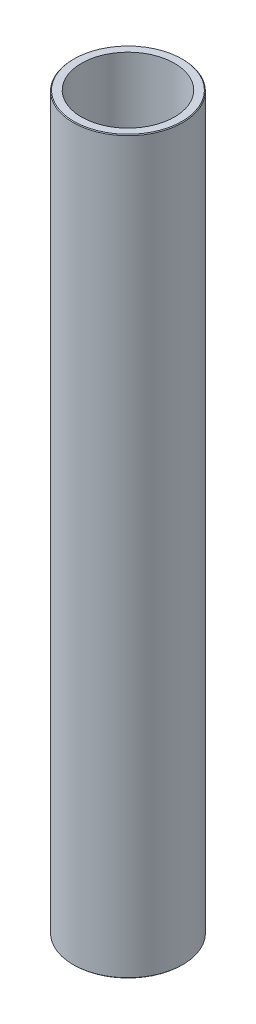
ISO-10303-21;
HEADER;
FILE_DESCRIPTION(('STEP AP214'),'2;1');
FILE_NAME('part.step','',(''),(''),'','','');
FILE_SCHEMA(('AUTOMOTIVE_DESIGN { 1 0 10303 214 1 1 1 1 }'));
ENDSEC;
DATA;
#1=APPLICATION_CONTEXT('core data for automotive mechanical design processes');
#2=APPLICATION_PROTOCOL_DEFINITION('international standard','automotive_design',2000,#1);
#3=PRODUCT_CONTEXT('',#1,'mechanical');
#4=PRODUCT('Part','Part','',(#3));
#5=PRODUCT_RELATED_PRODUCT_CATEGORY('part','',(#4));
#6=PRODUCT_DEFINITION_FORMATION('','',#4);
#7=PRODUCT_DEFINITION_CONTEXT('part definition',#1,'design');
#8=PRODUCT_DEFINITION('design','',#6,#7);
#9=PRODUCT_DEFINITION_SHAPE('','',#8);
#10=(LENGTH_UNIT() NAMED_UNIT(*) SI_UNIT(.MILLI.,.METRE.));
#11=(NAMED_UNIT(*) PLANE_ANGLE_UNIT() SI_UNIT($,.RADIAN.));
#12=(NAMED_UNIT(*) SI_UNIT($,.STERADIAN.) SOLID_ANGLE_UNIT());
#13=UNCERTAINTY_MEASURE_WITH_UNIT(LENGTH_MEASURE(1.E-05),#10,'distance_accuracy_value','');
#14=(GEOMETRIC_REPRESENTATION_CONTEXT(3) GLOBAL_UNCERTAINTY_ASSIGNED_CONTEXT((#13)) GLOBAL_UNIT_ASSIGNED_CONTEXT((#10,
#11,#12)) REPRESENTATION_CONTEXT('',''));
#15=CARTESIAN_POINT('',(0.,0.,0.));
#16=DIRECTION('',(0.,0.,1.));
#17=DIRECTION('',(1.,0.,0.));
#18=AXIS2_PLACEMENT_3D('',#15,#16,#17);
#19=CARTESIAN_POINT('',(0.,600.,0.));
#20=DIRECTION('',(0.,-1.,0.));
#21=DIRECTION('',(0.,0.,-1.));
#22=AXIS2_PLACEMENT_3D('',#19,#20,#21);
#23=CYLINDRICAL_SURFACE('',#22,45.);
#24=CARTESIAN_POINT('',(0.,599.400226660918,0.));
#25=DIRECTION('',(0.,1.,0.));
#26=DIRECTION('',(0.,0.,1.));
#27=AXIS2_PLACEMENT_3D('',#24,#25,#26);
#28=CIRCLE('',#27,45.);
#29=CARTESIAN_POINT('',(0.,599.400226660918,45.));
#30=VERTEX_POINT('',#29);
#31=EDGE_CURVE('E50',#30,#30,#28,.F.);
#32=ORIENTED_EDGE('',*,*,#31,.T.);
#33=EDGE_LOOP('',(#32));
#34=FACE_BOUND('',#33,.T.);
#35=CARTESIAN_POINT('',(0.,0.599773339081899,0.));
#36=DIRECTION('',(0.,1.,0.));
#37=DIRECTION('',(0.,0.,1.));
#38=AXIS2_PLACEMENT_3D('',#35,#36,#37);
#39=CIRCLE('',#38,45.);
#40=CARTESIAN_POINT('',(0.,0.599773339081899,45.));
#41=VERTEX_POINT('',#40);
#42=EDGE_CURVE('E51',#41,#41,#39,.T.);
#43=ORIENTED_EDGE('',*,*,#42,.T.);
#44=EDGE_LOOP('',(#43));
#45=FACE_BOUND('',#44,.T.);
#46=ADVANCED_FACE('F39',(#34,#45),#23,.T.);
#47=CARTESIAN_POINT('',(0.,600.,0.));
#48=DIRECTION('',(0.,1.,0.));
#49=DIRECTION('',(0.,0.,1.));
#50=AXIS2_PLACEMENT_3D('',#47,#48,#49);
#51=PLANE('',#50);
#52=CARTESIAN_POINT('',(0.,600.,0.));
#53=DIRECTION('',(0.,1.,0.));
#54=DIRECTION('',(0.,0.,1.));
#55=AXIS2_PLACEMENT_3D('',#52,#53,#54);
#56=CIRCLE('',#55,44.4002266609179);
#57=CARTESIAN_POINT('',(0.,600.,44.4002266609179));
#58=VERTEX_POINT('',#57);
#59=EDGE_CURVE('E54',#58,#58,#56,.T.);
#60=ORIENTED_EDGE('',*,*,#59,.T.);
#61=EDGE_LOOP('',(#60));
#62=FACE_BOUND('',#61,.T.);
#63=CARTESIAN_POINT('',(0.,600.,0.));
#64=DIRECTION('',(0.,1.,0.));
#65=DIRECTION('',(0.,0.,1.));
#66=AXIS2_PLACEMENT_3D('',#63,#64,#65);
#67=CIRCLE('',#66,38.2204776896906);
#68=CARTESIAN_POINT('',(0.,600.,38.2204776896906));
#69=VERTEX_POINT('',#68);
#70=EDGE_CURVE('E58',#69,#69,#67,.T.);
#71=ORIENTED_EDGE('',*,*,#70,.F.);
#72=EDGE_LOOP('',(#71));
#73=FACE_BOUND('',#72,.T.);
#74=ADVANCED_FACE('F69',(#62,#73),#51,.T.);
#75=CARTESIAN_POINT('',(0.,0.,0.));
#76=DIRECTION('',(0.,1.,0.));
#77=DIRECTION('',(0.,0.,1.));
#78=AXIS2_PLACEMENT_3D('',#75,#76,#77);
#79=PLANE('',#78);
#80=CARTESIAN_POINT('',(0.,0.,0.));
#81=DIRECTION('',(0.,1.,0.));
#82=DIRECTION('',(0.,0.,1.));
#83=AXIS2_PLACEMENT_3D('',#80,#81,#82);
#84=CIRCLE('',#83,44.4002266609181);
#85=CARTESIAN_POINT('',(0.,0.,44.4002266609181));
#86=VERTEX_POINT('',#85);
#87=EDGE_CURVE('E10',#86,#86,#84,.F.);
#88=ORIENTED_EDGE('',*,*,#87,.T.);
#89=EDGE_LOOP('',(#88));
#90=FACE_BOUND('',#89,.T.);
#91=CARTESIAN_POINT('',(0.,0.,0.));
#92=DIRECTION('',(0.,1.,0.));
#93=DIRECTION('',(0.,0.,1.));
#94=AXIS2_PLACEMENT_3D('',#91,#92,#93);
#95=CIRCLE('',#94,38.2204776896906);
#96=CARTESIAN_POINT('',(0.,0.,38.2204776896906));
#97=VERTEX_POINT('',#96);
#98=EDGE_CURVE('E63',#97,#97,#95,.T.);
#99=ORIENTED_EDGE('',*,*,#98,.T.);
#100=EDGE_LOOP('',(#99));
#101=FACE_BOUND('',#100,.T.);
#102=ADVANCED_FACE('F75',(#90,#101),#79,.F.);
#103=CARTESIAN_POINT('',(0.,600.,0.));
#104=DIRECTION('',(0.,-1.,0.));
#105=DIRECTION('',(0.,0.,-1.));
#106=AXIS2_PLACEMENT_3D('',#103,#104,#105);
#107=CYLINDRICAL_SURFACE('',#106,38.2204776896906);
#108=ORIENTED_EDGE('',*,*,#70,.T.);
#109=EDGE_LOOP('',(#108));
#110=FACE_BOUND('',#109,.T.);
#111=ORIENTED_EDGE('',*,*,#98,.F.);
#112=EDGE_LOOP('',(#111));
#113=FACE_BOUND('',#112,.T.);
#114=ADVANCED_FACE('F70',(#110,#113),#107,.F.);
#115=CARTESIAN_POINT('',(0.,600.,0.));
#116=DIRECTION('',(0.,-1.,0.));
#117=DIRECTION('',(0.,0.,-1.));
#118=AXIS2_PLACEMENT_3D('',#115,#116,#117);
#119=CONICAL_SURFACE('',#118,44.4002266609179,0.785398163397419);
#120=ORIENTED_EDGE('',*,*,#31,.F.);
#121=EDGE_LOOP('',(#120));
#122=FACE_BOUND('',#121,.T.);
#123=ORIENTED_EDGE('',*,*,#59,.F.);
#124=EDGE_LOOP('',(#123));
#125=FACE_BOUND('',#124,.T.);
#126=ADVANCED_FACE('F81',(#122,#125),#119,.T.);
#127=CARTESIAN_POINT('',(0.,0.599773339081899,0.));
#128=DIRECTION('',(0.,1.,0.));
#129=DIRECTION('',(0.,0.,1.));
#130=AXIS2_PLACEMENT_3D('',#127,#128,#129);
#131=CONICAL_SURFACE('',#130,45.,0.785398163397425);
#132=CARTESIAN_POINT('',(0.,0.,44.4002266609181));
#133=CARTESIAN_POINT('',(0.,0.00624763894876946,44.4064742998669));
#134=CARTESIAN_POINT('',(0.,0.0124952778975394,44.4127219388157));
#135=CARTESIAN_POINT('',(0.,0.0249905557950791,44.4252172167132));
#136=CARTESIAN_POINT('',(0.,0.031238194743849,44.431464855662));
#137=CARTESIAN_POINT('',(0.,0.0437334726413882,44.4439601335595));
#138=CARTESIAN_POINT('',(0.,0.0499811115901574,44.4502077725083));
#139=CARTESIAN_POINT('',(0.,0.0624763894876973,44.4627030504058));
#140=CARTESIAN_POINT('',(0.,0.0687240284364679,44.4689506893546));
#141=CARTESIAN_POINT('',(0.,0.0812193063340078,44.4814459672521));
#142=CARTESIAN_POINT('',(0.,0.0874669452827771,44.4876936062009));
#143=CARTESIAN_POINT('',(0.,0.0999622231803163,44.5001888840984));
#144=CARTESIAN_POINT('',(0.,0.106209862129086,44.5064365230472));
#145=CARTESIAN_POINT('',(0.,0.118705140026626,44.5189318009448));
#146=CARTESIAN_POINT('',(0.,0.124952778975396,44.5251794398935));
#147=CARTESIAN_POINT('',(0.,0.137448056872935,44.5376747177911));
#148=CARTESIAN_POINT('',(0.,0.143695695821705,44.5439223567398));
#149=CARTESIAN_POINT('',(0.,0.156190973719245,44.5564176346374));
#150=CARTESIAN_POINT('',(0.,0.162438612668014,44.5626652735861));
#151=CARTESIAN_POINT('',(0.,0.174933890565554,44.5751605514837));
#152=CARTESIAN_POINT('',(0.,0.181181529514324,44.5814081904324));
#153=CARTESIAN_POINT('',(0.,0.193676807411863,44.59390346833));
#154=CARTESIAN_POINT('',(0.,0.199924446360632,44.6001511072788));
#155=CARTESIAN_POINT('',(0.,0.212419724258172,44.6126463851763));
#156=CARTESIAN_POINT('',(0.,0.218667363206943,44.6188940241251));
#157=CARTESIAN_POINT('',(0.,0.231162641104483,44.6313893020226));
#158=CARTESIAN_POINT('',(0.,0.237410280053252,44.6376369409714));
#159=CARTESIAN_POINT('',(0.,0.249905557950791,44.6501322188689));
#160=CARTESIAN_POINT('',(0.,0.256153196899561,44.6563798578177));
#161=CARTESIAN_POINT('',(0.,0.268648474797101,44.6688751357152));
#162=CARTESIAN_POINT('',(0.,0.27489611374587,44.675122774664));
#163=CARTESIAN_POINT('',(0.,0.28739139164341,44.6876180525615));
#164=CARTESIAN_POINT('',(0.,0.29363903059218,44.6938656915103));
#165=CARTESIAN_POINT('',(0.,0.306134308489719,44.7063609694078));
#166=CARTESIAN_POINT('',(0.,0.312381947438489,44.7126086083566));
#167=CARTESIAN_POINT('',(0.,0.324877225336029,44.7251038862541));
#168=CARTESIAN_POINT('',(0.,0.331124864284799,44.7313515252029));
#169=CARTESIAN_POINT('',(0.,0.343620142182338,44.7438468031005));
#170=CARTESIAN_POINT('',(0.,0.349867781131107,44.7500944420492));
#171=CARTESIAN_POINT('',(0.,0.362363059028647,44.7625897199468));
#172=CARTESIAN_POINT('',(0.,0.368610697977418,44.7688373588955));
#173=CARTESIAN_POINT('',(0.,0.381105975874958,44.7813326367931));
#174=CARTESIAN_POINT('',(0.,0.387353614823727,44.7875802757418));
#175=CARTESIAN_POINT('',(0.,0.399848892721266,44.8000755536394));
#176=CARTESIAN_POINT('',(0.,0.406096531670036,44.8063231925882));
#177=CARTESIAN_POINT('',(0.,0.418591809567576,44.8188184704857));
#178=CARTESIAN_POINT('',(0.,0.424839448516345,44.8250661094345));
#179=CARTESIAN_POINT('',(0.,0.437334726413885,44.837561387332));
#180=CARTESIAN_POINT('',(0.,0.443582365362655,44.8438090262808));
#181=CARTESIAN_POINT('',(0.,0.456077643260194,44.8563043041783));
#182=CARTESIAN_POINT('',(0.,0.462325282208964,44.8625519431271));
#183=CARTESIAN_POINT('',(0.,0.474820560106504,44.8750472210246));
#184=CARTESIAN_POINT('',(0.,0.481068199055273,44.8812948599734));
#185=CARTESIAN_POINT('',(0.,0.493563476952813,44.8937901378709));
#186=CARTESIAN_POINT('',(0.,0.499811115901583,44.9000377768197));
#187=CARTESIAN_POINT('',(0.,0.512306393799122,44.9125330547172));
#188=CARTESIAN_POINT('',(0.,0.518554032747891,44.918780693666));
#189=CARTESIAN_POINT('',(0.,0.531049310645431,44.9312759715635));
#190=CARTESIAN_POINT('',(0.,0.537296949594202,44.9375236105123));
#191=CARTESIAN_POINT('',(0.,0.549792227491742,44.9500188884098));
#192=CARTESIAN_POINT('',(0.,0.556039866440511,44.9562665273586));
#193=CARTESIAN_POINT('',(0.,0.56853514433805,44.9687618052562));
#194=CARTESIAN_POINT('',(0.,0.57478278328682,44.9750094442049));
#195=CARTESIAN_POINT('',(0.,0.58727806118436,44.9875047221025));
#196=CARTESIAN_POINT('',(0.,0.59352570013313,44.9937523610512));
#197=CARTESIAN_POINT('',(0.,0.599773339081899,45.));
#198=B_SPLINE_CURVE_WITH_KNOTS('',3,(#132,#133,#134,#135,#136,#137,#138,#139,#140,#141,#142,
#143,#144,#145,#146,#147,#148,#149,#150,#151,#152,#153,#154,#155,#156,#157,#158,#159,#160,#161,
#162,#163,#164,#165,#166,#167,#168,#169,#170,#171,#172,#173,#174,#175,#176,#177,#178,#179,#180,
#181,#182,#183,#184,#185,#186,#187,#188,#189,#190,#191,#192,#193,#194,#195,#196,#197),
.UNSPECIFIED.,.F.,.F.,(4,2,2,2,2,2,2,2,2,2,2,2,2,2,2,2,2,2,2,2,2,2,2,2,2,2,2,2,2,2,2,2,4),(0.,
0.0265064872024818,0.0530129744049637,0.0795194616074455,0.106025948809922,0.132532436012404,
0.159038923214886,0.185545410417368,0.21205189761985,0.238558384822332,0.265064872024814,
0.291571359227295,0.318077846429772,0.344584333632254,0.371090820834736,0.397597308037218,
0.4241037952397,0.450610282442182,0.477116769644663,0.503623256847145,0.530129744049622,
0.556636231252104,0.583142718454586,0.609649205657068,0.63615569285955,0.662662180062031,
0.689168667264513,0.715675154466995,0.742181641669477,0.768688128871954,0.795194616074436,
0.821701103276918,0.8482075904794),.UNSPECIFIED.);
#199=EDGE_CURVE('BSEAM45',#86,#41,#198,.T.);
#200=ORIENTED_EDGE('',*,*,#87,.F.);
#201=ORIENTED_EDGE('',*,*,#42,.F.);
#202=ORIENTED_EDGE('',*,*,#199,.T.);
#203=ORIENTED_EDGE('',*,*,#199,.F.);
#204=EDGE_LOOP('',(#200,#202,#201,#203));
#205=FACE_BOUND('',#204,.T.);
#206=ADVANCED_FACE('F45',(#205),#131,.T.);
#207=CLOSED_SHELL('',(#46,#74,#102,#114,#126,#206));
#208=MANIFOLD_SOLID_BREP('B2',#207);
#209=ADVANCED_BREP_SHAPE_REPRESENTATION('',(#18,#208),#14);
#210=SHAPE_DEFINITION_REPRESENTATION(#9,#209);
ENDSEC;
END-ISO-10303-21;
